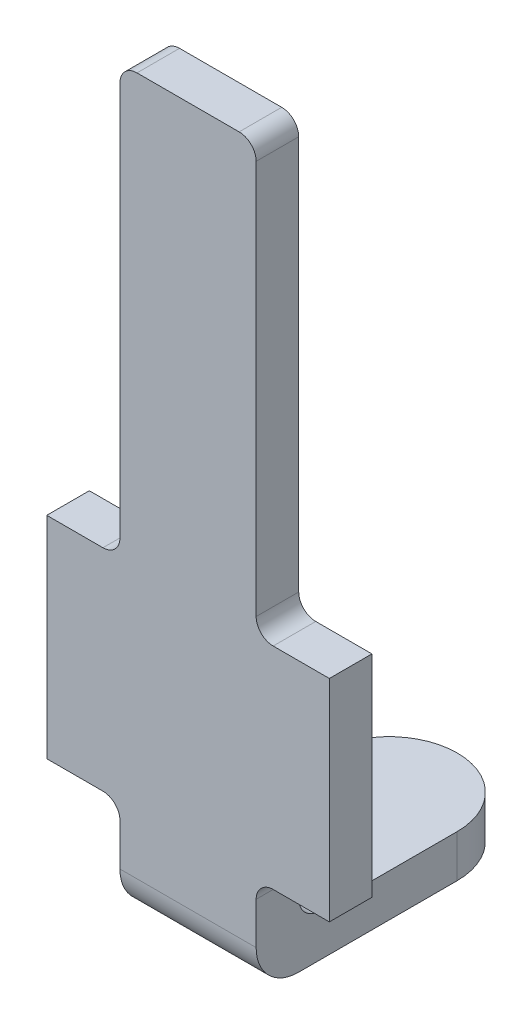
ISO-10303-21;
HEADER;
FILE_DESCRIPTION(('STEP AP214'),'2;1');
FILE_NAME('part.step','',(''),(''),'','','');
FILE_SCHEMA(('AUTOMOTIVE_DESIGN { 1 0 10303 214 1 1 1 1 }'));
ENDSEC;
DATA;
#1=APPLICATION_CONTEXT('core data for automotive mechanical design processes');
#2=APPLICATION_PROTOCOL_DEFINITION('international standard','automotive_design',2000,#1);
#3=PRODUCT_CONTEXT('',#1,'mechanical');
#4=PRODUCT('Part','Part','',(#3));
#5=PRODUCT_RELATED_PRODUCT_CATEGORY('part','',(#4));
#6=PRODUCT_DEFINITION_FORMATION('','',#4);
#7=PRODUCT_DEFINITION_CONTEXT('part definition',#1,'design');
#8=PRODUCT_DEFINITION('design','',#6,#7);
#9=PRODUCT_DEFINITION_SHAPE('','',#8);
#10=(LENGTH_UNIT() NAMED_UNIT(*) SI_UNIT(.MILLI.,.METRE.));
#11=(NAMED_UNIT(*) PLANE_ANGLE_UNIT() SI_UNIT($,.RADIAN.));
#12=(NAMED_UNIT(*) SI_UNIT($,.STERADIAN.) SOLID_ANGLE_UNIT());
#13=UNCERTAINTY_MEASURE_WITH_UNIT(LENGTH_MEASURE(1.E-05),#10,'distance_accuracy_value','');
#14=(GEOMETRIC_REPRESENTATION_CONTEXT(3) GLOBAL_UNCERTAINTY_ASSIGNED_CONTEXT((#13)) GLOBAL_UNIT_ASSIGNED_CONTEXT((#10,
#11,#12)) REPRESENTATION_CONTEXT('',''));
#15=CARTESIAN_POINT('',(0.,0.,0.));
#16=DIRECTION('',(0.,0.,1.));
#17=DIRECTION('',(1.,0.,0.));
#18=AXIS2_PLACEMENT_3D('',#15,#16,#17);
#19=CARTESIAN_POINT('',(5.85,1.48437551370885,-0.748999999999983));
#20=DIRECTION('',(0.,0.,-1.));
#21=DIRECTION('',(1.,0.,0.));
#22=AXIS2_PLACEMENT_3D('',#19,#20,#21);
#23=CYLINDRICAL_SURFACE('',#22,0.1);
#24=CARTESIAN_POINT('',(5.85,1.48437551370885,-0.498999999999983));
#25=DIRECTION('',(0.,0.,1.));
#26=DIRECTION('',(1.,0.,0.));
#27=AXIS2_PLACEMENT_3D('',#24,#25,#26);
#28=CIRCLE('',#27,0.1);
#29=CARTESIAN_POINT('',(5.85,1.38437551370885,-0.499000000000012));
#30=VERTEX_POINT('',#29);
#31=CARTESIAN_POINT('',(5.95,1.48437551370885,-0.498999999999983));
#32=VERTEX_POINT('',#31);
#33=EDGE_CURVE('E267',#30,#32,#28,.T.);
#34=ORIENTED_EDGE('',*,*,#33,.T.);
#35=DIRECTION('',(0.,0.,-1.));
#36=VECTOR('',#35,1.);
#37=CARTESIAN_POINT('',(5.95,1.48437551370885,-0.748999999999983));
#38=LINE('',#37,#36);
#39=CARTESIAN_POINT('',(5.95,1.48437551370885,-0.748999999999983));
#40=VERTEX_POINT('',#39);
#41=EDGE_CURVE('E282',#32,#40,#38,.T.);
#42=ORIENTED_EDGE('',*,*,#41,.T.);
#43=CARTESIAN_POINT('',(5.85,1.48437551370885,-0.748999999999983));
#44=DIRECTION('',(0.,0.,-1.));
#45=DIRECTION('',(-1.,0.,0.));
#46=AXIS2_PLACEMENT_3D('',#43,#44,#45);
#47=CIRCLE('',#46,0.1);
#48=CARTESIAN_POINT('',(5.85,1.38437551370885,-0.749000000000012));
#49=VERTEX_POINT('',#48);
#50=EDGE_CURVE('E292',#40,#49,#47,.T.);
#51=ORIENTED_EDGE('',*,*,#50,.T.);
#52=DIRECTION('',(0.,0.,1.));
#53=VECTOR('',#52,1.);
#54=CARTESIAN_POINT('',(5.85,1.38437551370885,-0.749000000000012));
#55=LINE('',#54,#53);
#56=EDGE_CURVE('E125',#49,#30,#55,.T.);
#57=ORIENTED_EDGE('',*,*,#56,.T.);
#58=EDGE_LOOP('',(#34,#42,#51,#57));
#59=FACE_BOUND('',#58,.T.);
#60=ADVANCED_FACE('F16',(#59),#23,.F.);
#61=CARTESIAN_POINT('',(6.85,1.48437551370885,-0.749000000000014));
#62=DIRECTION('',(0.,0.,1.));
#63=DIRECTION('',(-1.,0.,0.));
#64=AXIS2_PLACEMENT_3D('',#61,#62,#63);
#65=CYLINDRICAL_SURFACE('',#64,0.1);
#66=CARTESIAN_POINT('',(6.85,1.48437551370885,-0.498999999999985));
#67=DIRECTION('',(0.,0.,1.));
#68=DIRECTION('',(1.,0.,0.));
#69=AXIS2_PLACEMENT_3D('',#66,#67,#68);
#70=CIRCLE('',#69,0.1);
#71=CARTESIAN_POINT('',(6.75,1.48437551370885,-0.498999999999984));
#72=VERTEX_POINT('',#71);
#73=CARTESIAN_POINT('',(6.85,1.38437551370885,-0.499000000000013));
#74=VERTEX_POINT('',#73);
#75=EDGE_CURVE('E297',#72,#74,#70,.T.);
#76=ORIENTED_EDGE('',*,*,#75,.T.);
#77=DIRECTION('',(0.,0.,-1.));
#78=VECTOR('',#77,1.);
#79=CARTESIAN_POINT('',(6.85,1.38437551370885,-0.748999999999984));
#80=LINE('',#79,#78);
#81=CARTESIAN_POINT('',(6.85,1.38437551370885,-0.749000000000014));
#82=VERTEX_POINT('',#81);
#83=EDGE_CURVE('E40',#74,#82,#80,.T.);
#84=ORIENTED_EDGE('',*,*,#83,.T.);
#85=CARTESIAN_POINT('',(6.85,1.48437551370885,-0.748999999999984));
#86=DIRECTION('',(0.,0.,-1.));
#87=DIRECTION('',(-1.,0.,0.));
#88=AXIS2_PLACEMENT_3D('',#85,#86,#87);
#89=CIRCLE('',#88,0.1);
#90=CARTESIAN_POINT('',(6.75,1.48437551370885,-0.748999999999984));
#91=VERTEX_POINT('',#90);
#92=EDGE_CURVE('E299',#82,#91,#89,.T.);
#93=ORIENTED_EDGE('',*,*,#92,.T.);
#94=DIRECTION('',(0.,0.,1.));
#95=VECTOR('',#94,1.);
#96=CARTESIAN_POINT('',(6.75,1.48437551370885,-0.498999999999984));
#97=LINE('',#96,#95);
#98=EDGE_CURVE('E314',#91,#72,#97,.T.);
#99=ORIENTED_EDGE('',*,*,#98,.T.);
#100=EDGE_LOOP('',(#76,#84,#93,#99));
#101=FACE_BOUND('',#100,.T.);
#102=ADVANCED_FACE('F799',(#101),#65,.F.);
#103=CARTESIAN_POINT('',(5.85,0.0459658151929143,-0.749000000000012));
#104=DIRECTION('',(0.,0.,1.));
#105=DIRECTION('',(-1.,0.,0.));
#106=AXIS2_PLACEMENT_3D('',#103,#104,#105);
#107=CYLINDRICAL_SURFACE('',#106,0.1);
#108=CARTESIAN_POINT('',(5.85,0.0459658151929143,-0.498999999999983));
#109=DIRECTION('',(0.,0.,1.));
#110=DIRECTION('',(1.,0.,0.));
#111=AXIS2_PLACEMENT_3D('',#108,#109,#110);
#112=CIRCLE('',#111,0.1);
#113=CARTESIAN_POINT('',(5.95,0.0459658151929143,-0.498999999999983));
#114=VERTEX_POINT('',#113);
#115=CARTESIAN_POINT('',(5.85,0.145965815192914,-0.499000000000012));
#116=VERTEX_POINT('',#115);
#117=EDGE_CURVE('E373',#114,#116,#112,.T.);
#118=ORIENTED_EDGE('',*,*,#117,.T.);
#119=DIRECTION('',(0.,0.,-1.));
#120=VECTOR('',#119,1.);
#121=CARTESIAN_POINT('',(5.85,0.145965815192914,-0.748999999999983));
#122=LINE('',#121,#120);
#123=CARTESIAN_POINT('',(5.85,0.145965815192914,-0.749000000000012));
#124=VERTEX_POINT('',#123);
#125=EDGE_CURVE('E352',#116,#124,#122,.T.);
#126=ORIENTED_EDGE('',*,*,#125,.T.);
#127=CARTESIAN_POINT('',(5.85,0.0459658151929143,-0.748999999999983));
#128=DIRECTION('',(0.,0.,-1.));
#129=DIRECTION('',(-1.,0.,0.));
#130=AXIS2_PLACEMENT_3D('',#127,#128,#129);
#131=CIRCLE('',#130,0.1);
#132=CARTESIAN_POINT('',(5.95,0.0459658151929143,-0.748999999999983));
#133=VERTEX_POINT('',#132);
#134=EDGE_CURVE('E271',#124,#133,#131,.T.);
#135=ORIENTED_EDGE('',*,*,#134,.T.);
#136=DIRECTION('',(0.,0.,1.));
#137=VECTOR('',#136,1.);
#138=CARTESIAN_POINT('',(5.95,0.0459658151929143,-0.499000000000012));
#139=LINE('',#138,#137);
#140=EDGE_CURVE('E233',#133,#114,#139,.T.);
#141=ORIENTED_EDGE('',*,*,#140,.T.);
#142=EDGE_LOOP('',(#118,#126,#135,#141));
#143=FACE_BOUND('',#142,.T.);
#144=ADVANCED_FACE('F454',(#143),#107,.F.);
#145=CARTESIAN_POINT('',(6.85,0.0459658151929143,-0.748999999999984));
#146=DIRECTION('',(0.,0.,-1.));
#147=DIRECTION('',(1.,0.,0.));
#148=AXIS2_PLACEMENT_3D('',#145,#146,#147);
#149=CYLINDRICAL_SURFACE('',#148,0.1);
#150=CARTESIAN_POINT('',(6.85,0.0459658151929143,-0.498999999999984));
#151=DIRECTION('',(0.,0.,1.));
#152=DIRECTION('',(1.,0.,0.));
#153=AXIS2_PLACEMENT_3D('',#150,#151,#152);
#154=CIRCLE('',#153,0.1);
#155=CARTESIAN_POINT('',(6.85,0.145965815192914,-0.499000000000013));
#156=VERTEX_POINT('',#155);
#157=CARTESIAN_POINT('',(6.75,0.0459658151929143,-0.498999999999984));
#158=VERTEX_POINT('',#157);
#159=EDGE_CURVE('E273',#156,#158,#154,.T.);
#160=ORIENTED_EDGE('',*,*,#159,.T.);
#161=DIRECTION('',(0.,0.,-1.));
#162=VECTOR('',#161,1.);
#163=CARTESIAN_POINT('',(6.75,0.0459658151929143,-0.748999999999984));
#164=LINE('',#163,#162);
#165=CARTESIAN_POINT('',(6.75,0.0459658151929143,-0.748999999999984));
#166=VERTEX_POINT('',#165);
#167=EDGE_CURVE('E234',#158,#166,#164,.T.);
#168=ORIENTED_EDGE('',*,*,#167,.T.);
#169=CARTESIAN_POINT('',(6.85,0.0459658151929143,-0.748999999999984));
#170=DIRECTION('',(0.,0.,-1.));
#171=DIRECTION('',(-1.,0.,0.));
#172=AXIS2_PLACEMENT_3D('',#169,#170,#171);
#173=CIRCLE('',#172,0.1);
#174=CARTESIAN_POINT('',(6.85,0.145965815192914,-0.749000000000013));
#175=VERTEX_POINT('',#174);
#176=EDGE_CURVE('E308',#166,#175,#173,.T.);
#177=ORIENTED_EDGE('',*,*,#176,.T.);
#178=DIRECTION('',(0.,0.,1.));
#179=VECTOR('',#178,1.);
#180=CARTESIAN_POINT('',(6.85,0.145965815192914,-0.749000000000013));
#181=LINE('',#180,#179);
#182=EDGE_CURVE('E11',#175,#156,#181,.T.);
#183=ORIENTED_EDGE('',*,*,#182,.T.);
#184=EDGE_LOOP('',(#160,#168,#177,#183));
#185=FACE_BOUND('',#184,.T.);
#186=ADVANCED_FACE('F697',(#185),#149,.F.);
#187=CARTESIAN_POINT('',(6.05,3.8,-0.748999999999983));
#188=DIRECTION('',(0.,0.,1.));
#189=DIRECTION('',(-1.,0.,0.));
#190=AXIS2_PLACEMENT_3D('',#187,#188,#189);
#191=CYLINDRICAL_SURFACE('',#190,0.1);
#192=CARTESIAN_POINT('',(6.05,3.8,-0.498999999999984));
#193=DIRECTION('',(0.,0.,-1.));
#194=DIRECTION('',(1.,0.,0.));
#195=AXIS2_PLACEMENT_3D('',#192,#193,#194);
#196=CIRCLE('',#195,0.1);
#197=CARTESIAN_POINT('',(5.95,3.8,-0.498999999999984));
#198=VERTEX_POINT('',#197);
#199=CARTESIAN_POINT('',(6.05,3.9,-0.498999999999984));
#200=VERTEX_POINT('',#199);
#201=EDGE_CURVE('E322',#198,#200,#196,.T.);
#202=ORIENTED_EDGE('',*,*,#201,.T.);
#203=DIRECTION('',(0.,0.,-1.));
#204=VECTOR('',#203,1.);
#205=CARTESIAN_POINT('',(6.05,3.9,-0.748999999999983));
#206=LINE('',#205,#204);
#207=CARTESIAN_POINT('',(6.05,3.9,-0.748999999999983));
#208=VERTEX_POINT('',#207);
#209=EDGE_CURVE('E335',#200,#208,#206,.T.);
#210=ORIENTED_EDGE('',*,*,#209,.T.);
#211=CARTESIAN_POINT('',(6.05,3.8,-0.748999999999983));
#212=DIRECTION('',(0.,0.,1.));
#213=DIRECTION('',(-1.,0.,0.));
#214=AXIS2_PLACEMENT_3D('',#211,#212,#213);
#215=CIRCLE('',#214,0.1);
#216=CARTESIAN_POINT('',(5.95,3.8,-0.748999999999983));
#217=VERTEX_POINT('',#216);
#218=EDGE_CURVE('E330',#208,#217,#215,.T.);
#219=ORIENTED_EDGE('',*,*,#218,.T.);
#220=DIRECTION('',(0.,0.,1.));
#221=VECTOR('',#220,1.);
#222=CARTESIAN_POINT('',(5.95,3.8,-0.498999999999984));
#223=LINE('',#222,#221);
#224=EDGE_CURVE('E336',#217,#198,#223,.T.);
#225=ORIENTED_EDGE('',*,*,#224,.T.);
#226=EDGE_LOOP('',(#202,#210,#219,#225));
#227=FACE_BOUND('',#226,.T.);
#228=ADVANCED_FACE('F693',(#227),#191,.T.);
#229=CARTESIAN_POINT('',(6.65,3.8,-0.748999999999984));
#230=DIRECTION('',(0.,0.,-1.));
#231=DIRECTION('',(1.,0.,0.));
#232=AXIS2_PLACEMENT_3D('',#229,#230,#231);
#233=CYLINDRICAL_SURFACE('',#232,0.1);
#234=CARTESIAN_POINT('',(6.65,3.8,-0.498999999999985));
#235=DIRECTION('',(0.,0.,-1.));
#236=DIRECTION('',(1.,0.,0.));
#237=AXIS2_PLACEMENT_3D('',#234,#235,#236);
#238=CIRCLE('',#237,0.1);
#239=CARTESIAN_POINT('',(6.65,3.9,-0.498999999999985));
#240=VERTEX_POINT('',#239);
#241=CARTESIAN_POINT('',(6.75,3.8,-0.498999999999985));
#242=VERTEX_POINT('',#241);
#243=EDGE_CURVE('E342',#240,#242,#238,.T.);
#244=ORIENTED_EDGE('',*,*,#243,.T.);
#245=DIRECTION('',(0.,0.,-1.));
#246=VECTOR('',#245,1.);
#247=CARTESIAN_POINT('',(6.75,3.8,-0.748999999999984));
#248=LINE('',#247,#246);
#249=CARTESIAN_POINT('',(6.75,3.8,-0.748999999999984));
#250=VERTEX_POINT('',#249);
#251=EDGE_CURVE('E323',#242,#250,#248,.T.);
#252=ORIENTED_EDGE('',*,*,#251,.T.);
#253=CARTESIAN_POINT('',(6.65,3.8,-0.748999999999984));
#254=DIRECTION('',(0.,0.,1.));
#255=DIRECTION('',(-1.,0.,0.));
#256=AXIS2_PLACEMENT_3D('',#253,#254,#255);
#257=CIRCLE('',#256,0.1);
#258=CARTESIAN_POINT('',(6.65,3.9,-0.748999999999984));
#259=VERTEX_POINT('',#258);
#260=EDGE_CURVE('E327',#250,#259,#257,.T.);
#261=ORIENTED_EDGE('',*,*,#260,.T.);
#262=DIRECTION('',(0.,0.,1.));
#263=VECTOR('',#262,1.);
#264=CARTESIAN_POINT('',(6.65,3.9,-0.748999999999984));
#265=LINE('',#264,#263);
#266=EDGE_CURVE('E303',#259,#240,#265,.T.);
#267=ORIENTED_EDGE('',*,*,#266,.T.);
#268=EDGE_LOOP('',(#244,#252,#261,#267));
#269=FACE_BOUND('',#268,.T.);
#270=ADVANCED_FACE('F672',(#269),#233,.T.);
#271=CARTESIAN_POINT('',(7.18,0.,-1.00308650274883E-13));
#272=DIRECTION('',(-1.,0.,0.));
#273=DIRECTION('',(0.,1.,0.));
#274=AXIS2_PLACEMENT_3D('',#271,#272,#273);
#275=PLANE('',#274);
#276=DIRECTION('',(0.,0.,1.));
#277=VECTOR('',#276,1.);
#278=CARTESIAN_POINT('',(7.18,1.38437551370885,-0.749000000000014));
#279=LINE('',#278,#277);
#280=CARTESIAN_POINT('',(7.18,1.38437551370885,-0.749000000000014));
#281=VERTEX_POINT('',#280);
#282=CARTESIAN_POINT('',(7.18,1.38437551370885,-0.499000000000014));
#283=VERTEX_POINT('',#282);
#284=EDGE_CURVE('E279',#281,#283,#279,.T.);
#285=ORIENTED_EDGE('',*,*,#284,.T.);
#286=DIRECTION('',(0.,-1.,0.));
#287=VECTOR('',#286,1.);
#288=CARTESIAN_POINT('',(7.18,1.38437551370885,-0.499000000000014));
#289=LINE('',#288,#287);
#290=CARTESIAN_POINT('',(7.18,0.145965815192914,-0.499000000000014));
#291=VERTEX_POINT('',#290);
#292=EDGE_CURVE('E298',#283,#291,#289,.T.);
#293=ORIENTED_EDGE('',*,*,#292,.T.);
#294=DIRECTION('',(0.,0.,1.));
#295=VECTOR('',#294,1.);
#296=CARTESIAN_POINT('',(7.18,0.145965815192914,-0.749000000000014));
#297=LINE('',#296,#295);
#298=CARTESIAN_POINT('',(7.18,0.145965815192914,-0.749000000000014));
#299=VERTEX_POINT('',#298);
#300=EDGE_CURVE('E20',#299,#291,#297,.T.);
#301=ORIENTED_EDGE('',*,*,#300,.F.);
#302=DIRECTION('',(0.,-1.,0.));
#303=VECTOR('',#302,1.);
#304=CARTESIAN_POINT('',(7.18,1.38437551370885,-0.749000000000014));
#305=LINE('',#304,#303);
#306=EDGE_CURVE('E309',#281,#299,#305,.T.);
#307=ORIENTED_EDGE('',*,*,#306,.F.);
#308=EDGE_LOOP('',(#285,#293,#301,#307));
#309=FACE_BOUND('',#308,.T.);
#310=ADVANCED_FACE('F667',(#309),#275,.F.);
#311=CARTESIAN_POINT('',(5.52,0.145965815192914,-0.749000000000011));
#312=DIRECTION('',(0.,-1.,0.));
#313=DIRECTION('',(0.,0.,-1.));
#314=AXIS2_PLACEMENT_3D('',#311,#312,#313);
#315=PLANE('',#314);
#316=DIRECTION('',(1.,0.,0.));
#317=VECTOR('',#316,1.);
#318=CARTESIAN_POINT('',(5.52,0.145965815192914,-0.749000000000011));
#319=LINE('',#318,#317);
#320=EDGE_CURVE('E304',#175,#299,#319,.T.);
#321=ORIENTED_EDGE('',*,*,#320,.T.);
#322=ORIENTED_EDGE('',*,*,#300,.T.);
#323=DIRECTION('',(1.,0.,0.));
#324=VECTOR('',#323,1.);
#325=CARTESIAN_POINT('',(5.52,0.145965815192914,-0.499000000000011));
#326=LINE('',#325,#324);
#327=EDGE_CURVE('E277',#156,#291,#326,.T.);
#328=ORIENTED_EDGE('',*,*,#327,.F.);
#329=ORIENTED_EDGE('',*,*,#182,.F.);
#330=EDGE_LOOP('',(#321,#322,#328,#329));
#331=FACE_BOUND('',#330,.T.);
#332=ADVANCED_FACE('F671',(#331),#315,.T.);
#333=CARTESIAN_POINT('',(5.52,1.38437551370885,-0.749000000000012));
#334=DIRECTION('',(0.,-1.,0.));
#335=DIRECTION('',(0.,0.,-1.));
#336=AXIS2_PLACEMENT_3D('',#333,#334,#335);
#337=PLANE('',#336);
#338=DIRECTION('',(1.,0.,0.));
#339=VECTOR('',#338,1.);
#340=CARTESIAN_POINT('',(5.52,1.38437551370885,-0.499000000000011));
#341=LINE('',#340,#339);
#342=EDGE_CURVE('E294',#74,#283,#341,.T.);
#343=ORIENTED_EDGE('',*,*,#342,.T.);
#344=ORIENTED_EDGE('',*,*,#284,.F.);
#345=DIRECTION('',(1.,0.,0.));
#346=VECTOR('',#345,1.);
#347=CARTESIAN_POINT('',(5.52,1.38437551370885,-0.749000000000012));
#348=LINE('',#347,#346);
#349=EDGE_CURVE('E302',#82,#281,#348,.T.);
#350=ORIENTED_EDGE('',*,*,#349,.F.);
#351=ORIENTED_EDGE('',*,*,#83,.F.);
#352=EDGE_LOOP('',(#343,#344,#350,#351));
#353=FACE_BOUND('',#352,.T.);
#354=ADVANCED_FACE('F662',(#353),#337,.F.);
#355=CARTESIAN_POINT('',(5.52,1.38437551370885,-0.749000000000012));
#356=DIRECTION('',(0.,-1.,0.));
#357=DIRECTION('',(0.,0.,-1.));
#358=AXIS2_PLACEMENT_3D('',#355,#356,#357);
#359=PLANE('',#358);
#360=DIRECTION('',(1.,0.,0.));
#361=VECTOR('',#360,1.);
#362=CARTESIAN_POINT('',(5.52,1.38437551370885,-0.749000000000012));
#363=LINE('',#362,#361);
#364=CARTESIAN_POINT('',(5.52,1.38437551370885,-0.749000000000012));
#365=VERTEX_POINT('',#364);
#366=EDGE_CURVE('E288',#365,#49,#363,.T.);
#367=ORIENTED_EDGE('',*,*,#366,.F.);
#368=DIRECTION('',(0.,0.,1.));
#369=VECTOR('',#368,1.);
#370=CARTESIAN_POINT('',(5.52,1.38437551370885,-0.749000000000012));
#371=LINE('',#370,#369);
#372=CARTESIAN_POINT('',(5.52,1.38437551370885,-0.499000000000011));
#373=VERTEX_POINT('',#372);
#374=EDGE_CURVE('E139',#365,#373,#371,.T.);
#375=ORIENTED_EDGE('',*,*,#374,.T.);
#376=DIRECTION('',(1.,0.,0.));
#377=VECTOR('',#376,1.);
#378=CARTESIAN_POINT('',(5.52,1.38437551370885,-0.499000000000011));
#379=LINE('',#378,#377);
#380=EDGE_CURVE('E263',#373,#30,#379,.T.);
#381=ORIENTED_EDGE('',*,*,#380,.T.);
#382=ORIENTED_EDGE('',*,*,#56,.F.);
#383=EDGE_LOOP('',(#367,#375,#381,#382));
#384=FACE_BOUND('',#383,.T.);
#385=ADVANCED_FACE('F414',(#384),#359,.F.);
#386=CARTESIAN_POINT('',(5.52,0.145965815192914,-0.749000000000011));
#387=DIRECTION('',(0.,-1.,0.));
#388=DIRECTION('',(0.,0.,-1.));
#389=AXIS2_PLACEMENT_3D('',#386,#387,#388);
#390=PLANE('',#389);
#391=DIRECTION('',(1.,0.,0.));
#392=VECTOR('',#391,1.);
#393=CARTESIAN_POINT('',(5.52,0.145965815192914,-0.499000000000011));
#394=LINE('',#393,#392);
#395=CARTESIAN_POINT('',(5.52,0.145965815192914,-0.499000000000011));
#396=VERTEX_POINT('',#395);
#397=EDGE_CURVE('E378',#396,#116,#394,.T.);
#398=ORIENTED_EDGE('',*,*,#397,.F.);
#399=DIRECTION('',(0.,0.,1.));
#400=VECTOR('',#399,1.);
#401=CARTESIAN_POINT('',(5.52,0.145965815192914,-0.749000000000011));
#402=LINE('',#401,#400);
#403=CARTESIAN_POINT('',(5.52,0.145965815192914,-0.749000000000011));
#404=VERTEX_POINT('',#403);
#405=EDGE_CURVE('E355',#404,#396,#402,.T.);
#406=ORIENTED_EDGE('',*,*,#405,.F.);
#407=DIRECTION('',(1.,0.,0.));
#408=VECTOR('',#407,1.);
#409=CARTESIAN_POINT('',(5.52,0.145965815192914,-0.749000000000011));
#410=LINE('',#409,#408);
#411=EDGE_CURVE('E310',#404,#124,#410,.T.);
#412=ORIENTED_EDGE('',*,*,#411,.T.);
#413=ORIENTED_EDGE('',*,*,#125,.F.);
#414=EDGE_LOOP('',(#398,#406,#412,#413));
#415=FACE_BOUND('',#414,.T.);
#416=ADVANCED_FACE('F661',(#415),#390,.T.);
#417=CARTESIAN_POINT('',(5.52,0.,0.));
#418=DIRECTION('',(-1.,0.,0.));
#419=DIRECTION('',(0.,1.,0.));
#420=AXIS2_PLACEMENT_3D('',#417,#418,#419);
#421=PLANE('',#420);
#422=ORIENTED_EDGE('',*,*,#374,.F.);
#423=DIRECTION('',(0.,-1.,0.));
#424=VECTOR('',#423,1.);
#425=CARTESIAN_POINT('',(5.52,1.38437551370885,-0.749000000000012));
#426=LINE('',#425,#424);
#427=EDGE_CURVE('E293',#365,#404,#426,.T.);
#428=ORIENTED_EDGE('',*,*,#427,.T.);
#429=ORIENTED_EDGE('',*,*,#405,.T.);
#430=DIRECTION('',(0.,-1.,0.));
#431=VECTOR('',#430,1.);
#432=CARTESIAN_POINT('',(5.52,1.38437551370885,-0.499000000000011));
#433=LINE('',#432,#431);
#434=EDGE_CURVE('E266',#373,#396,#433,.T.);
#435=ORIENTED_EDGE('',*,*,#434,.F.);
#436=EDGE_LOOP('',(#422,#428,#429,#435));
#437=FACE_BOUND('',#436,.T.);
#438=ADVANCED_FACE('F634',(#437),#421,.T.);
#439=CARTESIAN_POINT('',(6.35,-0.2,-1.68));
#440=DIRECTION('',(0.,-1.,0.));
#441=DIRECTION('',(0.,0.,1.));
#442=AXIS2_PLACEMENT_3D('',#439,#440,#441);
#443=CYLINDRICAL_SURFACE('',#442,0.4);
#444=DIRECTION('',(0.,-1.,0.));
#445=VECTOR('',#444,1.);
#446=CARTESIAN_POINT('',(6.75,-0.2,-1.68));
#447=LINE('',#446,#445);
#448=CARTESIAN_POINT('',(6.75,-0.2,-1.68));
#449=VERTEX_POINT('',#448);
#450=CARTESIAN_POINT('',(6.75,-0.45,-1.68));
#451=VERTEX_POINT('',#450);
#452=EDGE_CURVE('E370',#449,#451,#447,.T.);
#453=ORIENTED_EDGE('',*,*,#452,.T.);
#454=CARTESIAN_POINT('',(6.35,-0.45,-1.68));
#455=DIRECTION('',(0.,1.,0.));
#456=DIRECTION('',(0.,0.,-1.));
#457=AXIS2_PLACEMENT_3D('',#454,#455,#456);
#458=CIRCLE('',#457,0.4);
#459=CARTESIAN_POINT('',(5.95,-0.45,-1.68));
#460=VERTEX_POINT('',#459);
#461=EDGE_CURVE('E227',#451,#460,#458,.T.);
#462=ORIENTED_EDGE('',*,*,#461,.T.);
#463=DIRECTION('',(0.,1.,0.));
#464=VECTOR('',#463,1.);
#465=CARTESIAN_POINT('',(5.95,-0.2,-1.68));
#466=LINE('',#465,#464);
#467=CARTESIAN_POINT('',(5.95,-0.2,-1.68));
#468=VERTEX_POINT('',#467);
#469=EDGE_CURVE('E221',#460,#468,#466,.T.);
#470=ORIENTED_EDGE('',*,*,#469,.T.);
#471=CARTESIAN_POINT('',(6.35,-0.2,-1.68));
#472=DIRECTION('',(0.,-1.,0.));
#473=DIRECTION('',(0.,0.,1.));
#474=AXIS2_PLACEMENT_3D('',#471,#472,#473);
#475=CIRCLE('',#474,0.4);
#476=EDGE_CURVE('E224',#468,#449,#475,.T.);
#477=ORIENTED_EDGE('',*,*,#476,.T.);
#478=EDGE_LOOP('',(#453,#462,#470,#477));
#479=FACE_BOUND('',#478,.T.);
#480=ADVANCED_FACE('F223',(#479),#443,.T.);
#481=CARTESIAN_POINT('',(5.95,-0.2,-0.748999999999983));
#482=DIRECTION('',(-1.,0.,0.));
#483=DIRECTION('',(0.,1.,0.));
#484=AXIS2_PLACEMENT_3D('',#481,#482,#483);
#485=PLANE('',#484);
#486=DIRECTION('',(0.,-1.,0.));
#487=VECTOR('',#486,1.);
#488=CARTESIAN_POINT('',(5.95,3.9,-0.748999999999983));
#489=LINE('',#488,#487);
#490=CARTESIAN_POINT('',(5.95,-0.0749999999999988,-0.748999999999983));
#491=VERTEX_POINT('',#490);
#492=EDGE_CURVE('E268',#133,#491,#489,.T.);
#493=ORIENTED_EDGE('',*,*,#492,.T.);
#494=CARTESIAN_POINT('',(5.95,-0.0749999999999988,-0.873999999999983));
#495=DIRECTION('',(1.,0.,0.));
#496=DIRECTION('',(0.,0.,-1.));
#497=AXIS2_PLACEMENT_3D('',#494,#495,#496);
#498=CIRCLE('',#497,0.125);
#499=CARTESIAN_POINT('',(5.95,-0.2,-0.873999999999983));
#500=VERTEX_POINT('',#499);
#501=EDGE_CURVE('E248',#491,#500,#498,.T.);
#502=ORIENTED_EDGE('',*,*,#501,.T.);
#503=DIRECTION('',(0.,0.,-1.));
#504=VECTOR('',#503,1.);
#505=CARTESIAN_POINT('',(5.95,-0.2,-0.873999999999983));
#506=LINE('',#505,#504);
#507=EDGE_CURVE('E239',#500,#468,#506,.T.);
#508=ORIENTED_EDGE('',*,*,#507,.T.);
#509=ORIENTED_EDGE('',*,*,#469,.F.);
#510=DIRECTION('',(0.,0.,1.));
#511=VECTOR('',#510,1.);
#512=CARTESIAN_POINT('',(5.95,-0.45,-0.748999999999983));
#513=LINE('',#512,#511);
#514=CARTESIAN_POINT('',(5.95,-0.45,-0.748999999999983));
#515=VERTEX_POINT('',#514);
#516=EDGE_CURVE('E394',#460,#515,#513,.T.);
#517=ORIENTED_EDGE('',*,*,#516,.T.);
#518=CARTESIAN_POINT('',(5.95,-0.2,-0.748999999999983));
#519=DIRECTION('',(-1.,0.,0.));
#520=DIRECTION('',(0.,0.,-1.));
#521=AXIS2_PLACEMENT_3D('',#518,#519,#520);
#522=CIRCLE('',#521,0.25);
#523=CARTESIAN_POINT('',(5.95,-0.2,-0.498999999999983));
#524=VERTEX_POINT('',#523);
#525=EDGE_CURVE('E351',#515,#524,#522,.T.);
#526=ORIENTED_EDGE('',*,*,#525,.T.);
#527=DIRECTION('',(0.,1.,0.));
#528=VECTOR('',#527,1.);
#529=CARTESIAN_POINT('',(5.95,3.9,-0.498999999999984));
#530=LINE('',#529,#528);
#531=EDGE_CURVE('E377',#524,#114,#530,.T.);
#532=ORIENTED_EDGE('',*,*,#531,.T.);
#533=ORIENTED_EDGE('',*,*,#140,.F.);
#534=EDGE_LOOP('',(#493,#502,#508,#509,#517,#526,#532,#533));
#535=FACE_BOUND('',#534,.T.);
#536=ADVANCED_FACE('F246',(#535),#485,.T.);
#537=CARTESIAN_POINT('',(6.75,-0.2,-0.748999999999984));
#538=DIRECTION('',(-1.,0.,0.));
#539=DIRECTION('',(0.,1.,0.));
#540=AXIS2_PLACEMENT_3D('',#537,#538,#539);
#541=PLANE('',#540);
#542=DIRECTION('',(0.,1.,0.));
#543=VECTOR('',#542,1.);
#544=CARTESIAN_POINT('',(6.75,3.9,-0.498999999999985));
#545=LINE('',#544,#543);
#546=CARTESIAN_POINT('',(6.75,-0.2,-0.498999999999984));
#547=VERTEX_POINT('',#546);
#548=EDGE_CURVE('E278',#547,#158,#545,.T.);
#549=ORIENTED_EDGE('',*,*,#548,.F.);
#550=CARTESIAN_POINT('',(6.75,-0.2,-0.748999999999984));
#551=DIRECTION('',(-1.,0.,0.));
#552=DIRECTION('',(0.,0.,-1.));
#553=AXIS2_PLACEMENT_3D('',#550,#551,#552);
#554=CIRCLE('',#553,0.25);
#555=CARTESIAN_POINT('',(6.75,-0.45,-0.748999999999984));
#556=VERTEX_POINT('',#555);
#557=EDGE_CURVE('E346',#556,#547,#554,.T.);
#558=ORIENTED_EDGE('',*,*,#557,.F.);
#559=DIRECTION('',(0.,0.,1.));
#560=VECTOR('',#559,1.);
#561=CARTESIAN_POINT('',(6.75,-0.45,-0.748999999999984));
#562=LINE('',#561,#560);
#563=EDGE_CURVE('E488',#451,#556,#562,.T.);
#564=ORIENTED_EDGE('',*,*,#563,.F.);
#565=ORIENTED_EDGE('',*,*,#452,.F.);
#566=DIRECTION('',(0.,0.,-1.));
#567=VECTOR('',#566,1.);
#568=CARTESIAN_POINT('',(6.75,-0.2,-0.873999999999984));
#569=LINE('',#568,#567);
#570=CARTESIAN_POINT('',(6.75,-0.2,-0.873999999999984));
#571=VERTEX_POINT('',#570);
#572=EDGE_CURVE('E241',#571,#449,#569,.T.);
#573=ORIENTED_EDGE('',*,*,#572,.F.);
#574=CARTESIAN_POINT('',(6.75,-0.0749999999999988,-0.873999999999984));
#575=DIRECTION('',(1.,0.,0.));
#576=DIRECTION('',(0.,0.,-1.));
#577=AXIS2_PLACEMENT_3D('',#574,#575,#576);
#578=CIRCLE('',#577,0.125);
#579=CARTESIAN_POINT('',(6.75,-0.0749999999999988,-0.748999999999984));
#580=VERTEX_POINT('',#579);
#581=EDGE_CURVE('E258',#580,#571,#578,.T.);
#582=ORIENTED_EDGE('',*,*,#581,.F.);
#583=DIRECTION('',(0.,-1.,0.));
#584=VECTOR('',#583,1.);
#585=CARTESIAN_POINT('',(6.75,3.9,-0.748999999999984));
#586=LINE('',#585,#584);
#587=EDGE_CURVE('E364',#166,#580,#586,.T.);
#588=ORIENTED_EDGE('',*,*,#587,.F.);
#589=ORIENTED_EDGE('',*,*,#167,.F.);
#590=EDGE_LOOP('',(#549,#558,#564,#565,#573,#582,#588,#589));
#591=FACE_BOUND('',#590,.T.);
#592=ADVANCED_FACE('F18',(#591),#541,.F.);
#593=CARTESIAN_POINT('',(6.75,3.9,-0.498999999999985));
#594=DIRECTION('',(0.,0.,-1.));
#595=DIRECTION('',(-1.,0.,0.));
#596=AXIS2_PLACEMENT_3D('',#593,#594,#595);
#597=PLANE('',#596);
#598=DIRECTION('',(-1.,0.,0.));
#599=VECTOR('',#598,1.);
#600=CARTESIAN_POINT('',(6.75,3.9,-0.498999999999985));
#601=LINE('',#600,#599);
#602=EDGE_CURVE('E381',#240,#200,#601,.T.);
#603=ORIENTED_EDGE('',*,*,#602,.T.);
#604=ORIENTED_EDGE('',*,*,#201,.F.);
#605=DIRECTION('',(0.,1.,0.));
#606=VECTOR('',#605,1.);
#607=CARTESIAN_POINT('',(5.95,3.9,-0.498999999999984));
#608=LINE('',#607,#606);
#609=EDGE_CURVE('E286',#32,#198,#608,.T.);
#610=ORIENTED_EDGE('',*,*,#609,.F.);
#611=ORIENTED_EDGE('',*,*,#33,.F.);
#612=ORIENTED_EDGE('',*,*,#380,.F.);
#613=ORIENTED_EDGE('',*,*,#434,.T.);
#614=ORIENTED_EDGE('',*,*,#397,.T.);
#615=ORIENTED_EDGE('',*,*,#117,.F.);
#616=ORIENTED_EDGE('',*,*,#531,.F.);
#617=DIRECTION('',(-1.,0.,0.));
#618=VECTOR('',#617,1.);
#619=CARTESIAN_POINT('',(6.75,-0.2,-0.498999999999984));
#620=LINE('',#619,#618);
#621=EDGE_CURVE('E350',#547,#524,#620,.T.);
#622=ORIENTED_EDGE('',*,*,#621,.F.);
#623=ORIENTED_EDGE('',*,*,#548,.T.);
#624=ORIENTED_EDGE('',*,*,#159,.F.);
#625=ORIENTED_EDGE('',*,*,#327,.T.);
#626=ORIENTED_EDGE('',*,*,#292,.F.);
#627=ORIENTED_EDGE('',*,*,#342,.F.);
#628=ORIENTED_EDGE('',*,*,#75,.F.);
#629=DIRECTION('',(0.,1.,0.));
#630=VECTOR('',#629,1.);
#631=CARTESIAN_POINT('',(6.75,3.9,-0.498999999999985));
#632=LINE('',#631,#630);
#633=EDGE_CURVE('E319',#72,#242,#632,.T.);
#634=ORIENTED_EDGE('',*,*,#633,.T.);
#635=ORIENTED_EDGE('',*,*,#243,.F.);
#636=EDGE_LOOP('',(#603,#604,#610,#611,#612,#613,#614,#615,#616,#622,#623,#624,#625,#626,#627,
#628,#634,#635));
#637=FACE_BOUND('',#636,.T.);
#638=ADVANCED_FACE('F417',(#637),#597,.F.);
#639=CARTESIAN_POINT('',(6.75,-0.2,-0.748999999999984));
#640=DIRECTION('',(-1.,0.,0.));
#641=DIRECTION('',(0.,0.,-1.));
#642=AXIS2_PLACEMENT_3D('',#639,#640,#641);
#643=CYLINDRICAL_SURFACE('',#642,0.25);
#644=ORIENTED_EDGE('',*,*,#525,.F.);
#645=DIRECTION('',(-1.,0.,0.));
#646=VECTOR('',#645,1.);
#647=CARTESIAN_POINT('',(6.75,-0.45,-0.748999999999984));
#648=LINE('',#647,#646);
#649=EDGE_CURVE('E397',#556,#515,#648,.T.);
#650=ORIENTED_EDGE('',*,*,#649,.F.);
#651=ORIENTED_EDGE('',*,*,#557,.T.);
#652=ORIENTED_EDGE('',*,*,#621,.T.);
#653=EDGE_LOOP('',(#644,#650,#651,#652));
#654=FACE_BOUND('',#653,.T.);
#655=ADVANCED_FACE('F730',(#654),#643,.T.);
#656=CARTESIAN_POINT('',(6.75,-0.45,-0.748999999999984));
#657=DIRECTION('',(0.,1.,0.));
#658=DIRECTION('',(0.,0.,-1.));
#659=AXIS2_PLACEMENT_3D('',#656,#657,#658);
#660=PLANE('',#659);
#661=ORIENTED_EDGE('',*,*,#461,.F.);
#662=ORIENTED_EDGE('',*,*,#563,.T.);
#663=ORIENTED_EDGE('',*,*,#649,.T.);
#664=ORIENTED_EDGE('',*,*,#516,.F.);
#665=EDGE_LOOP('',(#661,#662,#663,#664));
#666=FACE_BOUND('',#665,.T.);
#667=ADVANCED_FACE('F688',(#666),#660,.F.);
#668=CARTESIAN_POINT('',(6.75,-0.2,-0.873999999999984));
#669=DIRECTION('',(0.,-1.,0.));
#670=DIRECTION('',(-1.,0.,0.));
#671=AXIS2_PLACEMENT_3D('',#668,#669,#670);
#672=PLANE('',#671);
#673=ORIENTED_EDGE('',*,*,#507,.F.);
#674=DIRECTION('',(-1.,0.,0.));
#675=VECTOR('',#674,1.);
#676=CARTESIAN_POINT('',(6.75,-0.2,-0.873999999999984));
#677=LINE('',#676,#675);
#678=EDGE_CURVE('E250',#571,#500,#677,.T.);
#679=ORIENTED_EDGE('',*,*,#678,.F.);
#680=ORIENTED_EDGE('',*,*,#572,.T.);
#681=ORIENTED_EDGE('',*,*,#476,.F.);
#682=EDGE_LOOP('',(#673,#679,#680,#681));
#683=FACE_BOUND('',#682,.T.);
#684=ADVANCED_FACE('F237',(#683),#672,.F.);
#685=CARTESIAN_POINT('',(6.75,-0.0749999999999988,-0.873999999999984));
#686=DIRECTION('',(-1.,0.,0.));
#687=DIRECTION('',(0.,0.,-1.));
#688=AXIS2_PLACEMENT_3D('',#685,#686,#687);
#689=CYLINDRICAL_SURFACE('',#688,0.125);
#690=ORIENTED_EDGE('',*,*,#501,.F.);
#691=DIRECTION('',(-1.,0.,0.));
#692=VECTOR('',#691,1.);
#693=CARTESIAN_POINT('',(6.75,-0.0749999999999988,-0.748999999999984));
#694=LINE('',#693,#692);
#695=EDGE_CURVE('E272',#580,#491,#694,.T.);
#696=ORIENTED_EDGE('',*,*,#695,.F.);
#697=ORIENTED_EDGE('',*,*,#581,.T.);
#698=ORIENTED_EDGE('',*,*,#678,.T.);
#699=EDGE_LOOP('',(#690,#696,#697,#698));
#700=FACE_BOUND('',#699,.T.);
#701=ADVANCED_FACE('F648',(#700),#689,.F.);
#702=CARTESIAN_POINT('',(6.75,3.9,-0.748999999999984));
#703=DIRECTION('',(0.,0.,1.));
#704=DIRECTION('',(1.,0.,0.));
#705=AXIS2_PLACEMENT_3D('',#702,#703,#704);
#706=PLANE('',#705);
#707=DIRECTION('',(0.,-1.,0.));
#708=VECTOR('',#707,1.);
#709=CARTESIAN_POINT('',(6.75,3.9,-0.748999999999984));
#710=LINE('',#709,#708);
#711=EDGE_CURVE('E318',#250,#91,#710,.T.);
#712=ORIENTED_EDGE('',*,*,#711,.T.);
#713=ORIENTED_EDGE('',*,*,#92,.F.);
#714=ORIENTED_EDGE('',*,*,#349,.T.);
#715=ORIENTED_EDGE('',*,*,#306,.T.);
#716=ORIENTED_EDGE('',*,*,#320,.F.);
#717=ORIENTED_EDGE('',*,*,#176,.F.);
#718=ORIENTED_EDGE('',*,*,#587,.T.);
#719=ORIENTED_EDGE('',*,*,#695,.T.);
#720=ORIENTED_EDGE('',*,*,#492,.F.);
#721=ORIENTED_EDGE('',*,*,#134,.F.);
#722=ORIENTED_EDGE('',*,*,#411,.F.);
#723=ORIENTED_EDGE('',*,*,#427,.F.);
#724=ORIENTED_EDGE('',*,*,#366,.T.);
#725=ORIENTED_EDGE('',*,*,#50,.F.);
#726=DIRECTION('',(0.,-1.,0.));
#727=VECTOR('',#726,1.);
#728=CARTESIAN_POINT('',(5.95,3.9,-0.748999999999983));
#729=LINE('',#728,#727);
#730=EDGE_CURVE('E287',#217,#40,#729,.T.);
#731=ORIENTED_EDGE('',*,*,#730,.F.);
#732=ORIENTED_EDGE('',*,*,#218,.F.);
#733=DIRECTION('',(-1.,0.,0.));
#734=VECTOR('',#733,1.);
#735=CARTESIAN_POINT('',(6.75,3.9,-0.748999999999984));
#736=LINE('',#735,#734);
#737=EDGE_CURVE('E331',#259,#208,#736,.T.);
#738=ORIENTED_EDGE('',*,*,#737,.F.);
#739=ORIENTED_EDGE('',*,*,#260,.F.);
#740=EDGE_LOOP('',(#712,#713,#714,#715,#716,#717,#718,#719,#720,#721,#722,#723,#724,#725,#731,
#732,#738,#739));
#741=FACE_BOUND('',#740,.T.);
#742=ADVANCED_FACE('F652',(#741),#706,.F.);
#743=CARTESIAN_POINT('',(6.75,3.9,-0.748999999999984));
#744=DIRECTION('',(0.,-1.,0.));
#745=DIRECTION('',(0.,0.,-1.));
#746=AXIS2_PLACEMENT_3D('',#743,#744,#745);
#747=PLANE('',#746);
#748=ORIENTED_EDGE('',*,*,#737,.T.);
#749=ORIENTED_EDGE('',*,*,#209,.F.);
#750=ORIENTED_EDGE('',*,*,#602,.F.);
#751=ORIENTED_EDGE('',*,*,#266,.F.);
#752=EDGE_LOOP('',(#748,#749,#750,#751));
#753=FACE_BOUND('',#752,.T.);
#754=ADVANCED_FACE('F643',(#753),#747,.F.);
#755=CARTESIAN_POINT('',(5.95,-0.2,-0.748999999999983));
#756=DIRECTION('',(-1.,0.,0.));
#757=DIRECTION('',(0.,1.,0.));
#758=AXIS2_PLACEMENT_3D('',#755,#756,#757);
#759=PLANE('',#758);
#760=ORIENTED_EDGE('',*,*,#730,.T.);
#761=ORIENTED_EDGE('',*,*,#41,.F.);
#762=ORIENTED_EDGE('',*,*,#609,.T.);
#763=ORIENTED_EDGE('',*,*,#224,.F.);
#764=EDGE_LOOP('',(#760,#761,#762,#763));
#765=FACE_BOUND('',#764,.T.);
#766=ADVANCED_FACE('F426',(#765),#759,.T.);
#767=CARTESIAN_POINT('',(6.75,-0.2,-0.748999999999984));
#768=DIRECTION('',(-1.,0.,0.));
#769=DIRECTION('',(0.,1.,0.));
#770=AXIS2_PLACEMENT_3D('',#767,#768,#769);
#771=PLANE('',#770);
#772=ORIENTED_EDGE('',*,*,#633,.F.);
#773=ORIENTED_EDGE('',*,*,#98,.F.);
#774=ORIENTED_EDGE('',*,*,#711,.F.);
#775=ORIENTED_EDGE('',*,*,#251,.F.);
#776=EDGE_LOOP('',(#772,#773,#774,#775));
#777=FACE_BOUND('',#776,.T.);
#778=ADVANCED_FACE('F642',(#777),#771,.F.);
#779=CLOSED_SHELL('',(#60,#102,#144,#186,#228,#270,#310,#332,#354,#385,#416,#438,#480,#536,#592,
#638,#655,#667,#684,#701,#742,#754,#766,#778));
#780=MANIFOLD_SOLID_BREP('B1',#779);
#781=ADVANCED_BREP_SHAPE_REPRESENTATION('',(#18,#780),#14);
#782=SHAPE_DEFINITION_REPRESENTATION(#9,#781);
ENDSEC;
END-ISO-10303-21;
